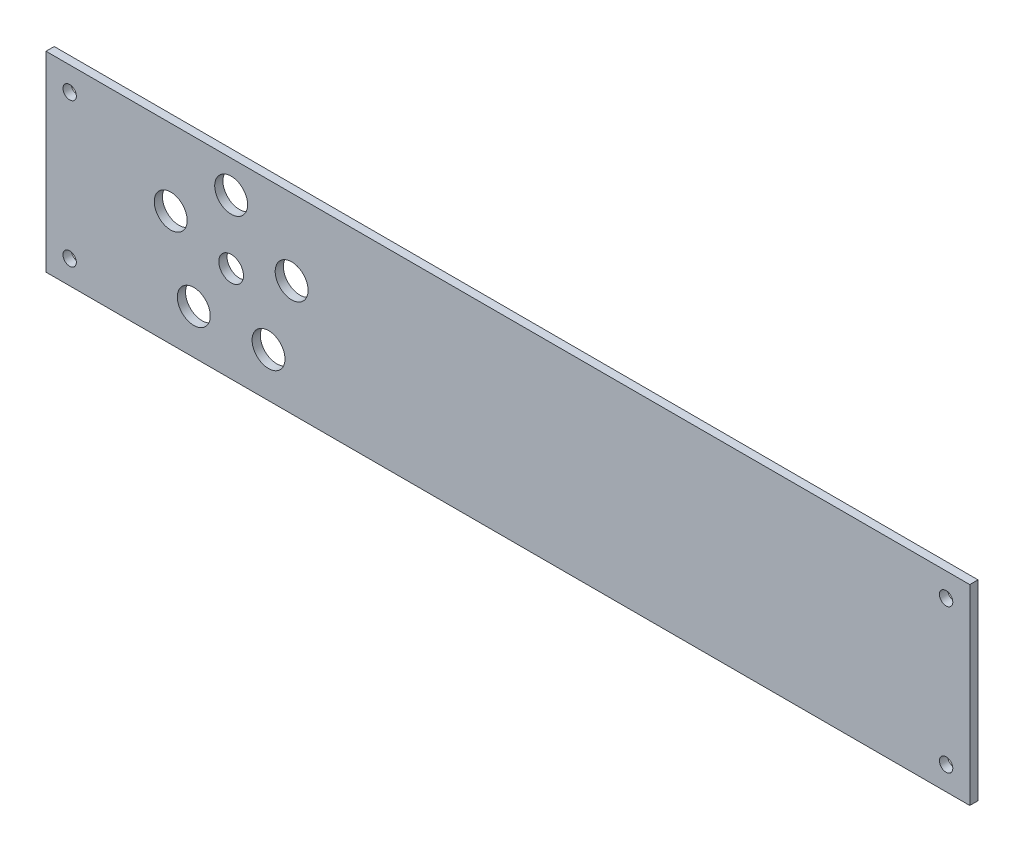
ISO-10303-21;
HEADER;
FILE_DESCRIPTION(('STEP AP214'),'2;1');
FILE_NAME('part.step','',(''),(''),'','','');
FILE_SCHEMA(('AUTOMOTIVE_DESIGN { 1 0 10303 214 1 1 1 1 }'));
ENDSEC;
DATA;
#1=APPLICATION_CONTEXT('core data for automotive mechanical design processes');
#2=APPLICATION_PROTOCOL_DEFINITION('international standard','automotive_design',2000,#1);
#3=PRODUCT_CONTEXT('',#1,'mechanical');
#4=PRODUCT('Part','Part','',(#3));
#5=PRODUCT_RELATED_PRODUCT_CATEGORY('part','',(#4));
#6=PRODUCT_DEFINITION_FORMATION('','',#4);
#7=PRODUCT_DEFINITION_CONTEXT('part definition',#1,'design');
#8=PRODUCT_DEFINITION('design','',#6,#7);
#9=PRODUCT_DEFINITION_SHAPE('','',#8);
#10=(LENGTH_UNIT() NAMED_UNIT(*) SI_UNIT(.MILLI.,.METRE.));
#11=(NAMED_UNIT(*) PLANE_ANGLE_UNIT() SI_UNIT($,.RADIAN.));
#12=(NAMED_UNIT(*) SI_UNIT($,.STERADIAN.) SOLID_ANGLE_UNIT());
#13=UNCERTAINTY_MEASURE_WITH_UNIT(LENGTH_MEASURE(1.E-05),#10,'distance_accuracy_value','');
#14=(GEOMETRIC_REPRESENTATION_CONTEXT(3) GLOBAL_UNCERTAINTY_ASSIGNED_CONTEXT((#13)) GLOBAL_UNIT_ASSIGNED_CONTEXT((#10,
#11,#12)) REPRESENTATION_CONTEXT('',''));
#15=CARTESIAN_POINT('',(0.,0.,0.));
#16=DIRECTION('',(0.,0.,1.));
#17=DIRECTION('',(1.,0.,0.));
#18=AXIS2_PLACEMENT_3D('',#15,#16,#17);
#19=CARTESIAN_POINT('',(0.,0.,4.));
#20=DIRECTION('',(0.,0.,1.));
#21=DIRECTION('',(1.,0.,0.));
#22=AXIS2_PLACEMENT_3D('',#19,#20,#21);
#23=PLANE('',#22);
#24=CARTESIAN_POINT('',(-377.163563200134,21.4999999999999,4.));
#25=DIRECTION('',(0.,0.,1.));
#26=DIRECTION('',(1.,0.,0.));
#27=AXIS2_PLACEMENT_3D('',#24,#25,#26);
#28=CIRCLE('',#27,7.99999999999998);
#29=CARTESIAN_POINT('',(-369.163563200134,21.4999999999999,4.));
#30=VERTEX_POINT('',#29);
#31=EDGE_CURVE('E223',#30,#30,#28,.T.);
#32=ORIENTED_EDGE('',*,*,#31,.F.);
#33=EDGE_LOOP('',(#32));
#34=FACE_BOUND('',#33,.T.);
#35=CARTESIAN_POINT('',(-329.610737385376,56.0491502812527,4.));
#36=DIRECTION('',(0.,0.,1.));
#37=DIRECTION('',(1.,0.,0.));
#38=AXIS2_PLACEMENT_3D('',#35,#36,#37);
#39=CIRCLE('',#38,7.99999999999998);
#40=CARTESIAN_POINT('',(-321.610737385376,56.0491502812527,4.));
#41=VERTEX_POINT('',#40);
#42=EDGE_CURVE('E168',#41,#41,#39,.T.);
#43=ORIENTED_EDGE('',*,*,#42,.F.);
#44=EDGE_LOOP('',(#43));
#45=FACE_BOUND('',#44,.T.);
#46=CARTESIAN_POINT('',(-11.5,11.5000000000001,4.));
#47=DIRECTION('',(0.,0.,1.));
#48=DIRECTION('',(1.,0.,0.));
#49=AXIS2_PLACEMENT_3D('',#46,#47,#48);
#50=CIRCLE('',#49,3.25);
#51=CARTESIAN_POINT('',(-8.24999999999996,11.5000000000001,4.));
#52=VERTEX_POINT('',#51);
#53=EDGE_CURVE('E169',#52,#52,#50,.T.);
#54=ORIENTED_EDGE('',*,*,#53,.F.);
#55=EDGE_LOOP('',(#54));
#56=FACE_BOUND('',#55,.T.);
#57=CARTESIAN_POINT('',(-359.,77.4016994374947,4.));
#58=DIRECTION('',(0.,0.,1.));
#59=DIRECTION('',(1.,0.,0.));
#60=AXIS2_PLACEMENT_3D('',#57,#58,#59);
#61=CIRCLE('',#60,7.99999999999999);
#62=CARTESIAN_POINT('',(-351.,77.4016994374947,4.));
#63=VERTEX_POINT('',#62);
#64=EDGE_CURVE('E186',#63,#63,#61,.T.);
#65=ORIENTED_EDGE('',*,*,#64,.F.);
#66=EDGE_LOOP('',(#65));
#67=FACE_BOUND('',#66,.T.);
#68=CARTESIAN_POINT('',(-437.5,81.4999999999999,4.));
#69=DIRECTION('',(0.,0.,1.));
#70=DIRECTION('',(1.,0.,0.));
#71=AXIS2_PLACEMENT_3D('',#68,#69,#70);
#72=CIRCLE('',#71,3.24999999999995);
#73=CARTESIAN_POINT('',(-434.25,81.4999999999999,4.));
#74=VERTEX_POINT('',#73);
#75=EDGE_CURVE('E120',#74,#74,#72,.T.);
#76=ORIENTED_EDGE('',*,*,#75,.F.);
#77=EDGE_LOOP('',(#76));
#78=FACE_BOUND('',#77,.T.);
#79=DIRECTION('',(0.,1.,0.));
#80=VECTOR('',#79,1.);
#81=CARTESIAN_POINT('',(0.,0.,4.));
#82=LINE('',#81,#80);
#83=CARTESIAN_POINT('',(0.,0.,4.));
#84=VERTEX_POINT('',#83);
#85=CARTESIAN_POINT('',(0.,92.9999999999999,4.));
#86=VERTEX_POINT('',#85);
#87=EDGE_CURVE('E100',#84,#86,#82,.T.);
#88=ORIENTED_EDGE('',*,*,#87,.T.);
#89=DIRECTION('',(-1.,0.,0.));
#90=VECTOR('',#89,1.);
#91=CARTESIAN_POINT('',(0.,92.9999999999999,4.));
#92=LINE('',#91,#90);
#93=CARTESIAN_POINT('',(-449.,92.9999999999999,4.));
#94=VERTEX_POINT('',#93);
#95=EDGE_CURVE('E95',#86,#94,#92,.T.);
#96=ORIENTED_EDGE('',*,*,#95,.T.);
#97=DIRECTION('',(0.,-1.,0.));
#98=VECTOR('',#97,1.);
#99=CARTESIAN_POINT('',(-449.,0.,4.));
#100=LINE('',#99,#98);
#101=CARTESIAN_POINT('',(-449.,0.,4.));
#102=VERTEX_POINT('',#101);
#103=EDGE_CURVE('E98',#94,#102,#100,.T.);
#104=ORIENTED_EDGE('',*,*,#103,.T.);
#105=DIRECTION('',(1.,0.,0.));
#106=VECTOR('',#105,1.);
#107=CARTESIAN_POINT('',(0.,0.,4.));
#108=LINE('',#107,#106);
#109=EDGE_CURVE('E63',#102,#84,#108,.T.);
#110=ORIENTED_EDGE('',*,*,#109,.T.);
#111=EDGE_LOOP('',(#88,#96,#104,#110));
#112=FACE_BOUND('',#111,.T.);
#113=CARTESIAN_POINT('',(-388.389262614624,56.0491502812526,4.));
#114=DIRECTION('',(0.,0.,1.));
#115=DIRECTION('',(1.,0.,0.));
#116=AXIS2_PLACEMENT_3D('',#113,#114,#115);
#117=CIRCLE('',#116,7.99999999999998);
#118=CARTESIAN_POINT('',(-380.389262614624,56.0491502812526,4.));
#119=VERTEX_POINT('',#118);
#120=EDGE_CURVE('E142',#119,#119,#117,.T.);
#121=ORIENTED_EDGE('',*,*,#120,.F.);
#122=EDGE_LOOP('',(#121));
#123=FACE_BOUND('',#122,.T.);
#124=CARTESIAN_POINT('',(-11.5,81.4999999999998,4.));
#125=DIRECTION('',(0.,0.,1.));
#126=DIRECTION('',(-1.,0.,0.));
#127=AXIS2_PLACEMENT_3D('',#124,#125,#126);
#128=CIRCLE('',#127,3.25);
#129=CARTESIAN_POINT('',(-14.75,81.4999999999998,4.));
#130=VERTEX_POINT('',#129);
#131=EDGE_CURVE('E187',#130,#130,#128,.T.);
#132=ORIENTED_EDGE('',*,*,#131,.F.);
#133=EDGE_LOOP('',(#132));
#134=FACE_BOUND('',#133,.T.);
#135=CARTESIAN_POINT('',(-437.5,11.4999999999999,4.));
#136=DIRECTION('',(0.,0.,1.));
#137=DIRECTION('',(-1.,0.,0.));
#138=AXIS2_PLACEMENT_3D('',#135,#136,#137);
#139=CIRCLE('',#138,3.24999999999995);
#140=CARTESIAN_POINT('',(-440.75,11.4999999999999,4.));
#141=VERTEX_POINT('',#140);
#142=EDGE_CURVE('E155',#141,#141,#139,.T.);
#143=ORIENTED_EDGE('',*,*,#142,.F.);
#144=EDGE_LOOP('',(#143));
#145=FACE_BOUND('',#144,.T.);
#146=CARTESIAN_POINT('',(-340.836436799866,21.5,4.));
#147=DIRECTION('',(0.,0.,1.));
#148=DIRECTION('',(1.,0.,0.));
#149=AXIS2_PLACEMENT_3D('',#146,#147,#148);
#150=CIRCLE('',#149,8.00000000000003);
#151=CARTESIAN_POINT('',(-332.836436799866,21.5,4.));
#152=VERTEX_POINT('',#151);
#153=EDGE_CURVE('E211',#152,#152,#150,.T.);
#154=ORIENTED_EDGE('',*,*,#153,.F.);
#155=EDGE_LOOP('',(#154));
#156=FACE_BOUND('',#155,.T.);
#157=CARTESIAN_POINT('',(-359.,46.4999999999999,4.));
#158=DIRECTION('',(0.,0.,1.));
#159=DIRECTION('',(1.,0.,0.));
#160=AXIS2_PLACEMENT_3D('',#157,#158,#159);
#161=CIRCLE('',#160,5.99999999999999);
#162=CARTESIAN_POINT('',(-353.,46.4999999999999,4.));
#163=VERTEX_POINT('',#162);
#164=EDGE_CURVE('E214',#163,#163,#161,.T.);
#165=ORIENTED_EDGE('',*,*,#164,.F.);
#166=EDGE_LOOP('',(#165));
#167=FACE_BOUND('',#166,.T.);
#168=ADVANCED_FACE('F45',(#34,#45,#56,#67,#78,#112,#123,#134,#145,#156,#167),#23,.T.);
#169=CARTESIAN_POINT('',(0.,0.,0.));
#170=DIRECTION('',(0.,0.,1.));
#171=DIRECTION('',(1.,0.,0.));
#172=AXIS2_PLACEMENT_3D('',#169,#170,#171);
#173=PLANE('',#172);
#174=DIRECTION('',(0.,1.,0.));
#175=VECTOR('',#174,1.);
#176=CARTESIAN_POINT('',(0.,0.,0.));
#177=LINE('',#176,#175);
#178=CARTESIAN_POINT('',(0.,0.,0.));
#179=VERTEX_POINT('',#178);
#180=CARTESIAN_POINT('',(0.,92.9999999999999,0.));
#181=VERTEX_POINT('',#180);
#182=EDGE_CURVE('E116',#179,#181,#177,.T.);
#183=ORIENTED_EDGE('',*,*,#182,.F.);
#184=DIRECTION('',(1.,0.,0.));
#185=VECTOR('',#184,1.);
#186=CARTESIAN_POINT('',(0.,0.,0.));
#187=LINE('',#186,#185);
#188=CARTESIAN_POINT('',(-449.,0.,0.));
#189=VERTEX_POINT('',#188);
#190=EDGE_CURVE('E88',#189,#179,#187,.T.);
#191=ORIENTED_EDGE('',*,*,#190,.F.);
#192=DIRECTION('',(0.,-1.,0.));
#193=VECTOR('',#192,1.);
#194=CARTESIAN_POINT('',(-449.,0.,0.));
#195=LINE('',#194,#193);
#196=CARTESIAN_POINT('',(-449.,92.9999999999999,0.));
#197=VERTEX_POINT('',#196);
#198=EDGE_CURVE('E82',#197,#189,#195,.T.);
#199=ORIENTED_EDGE('',*,*,#198,.F.);
#200=DIRECTION('',(-1.,0.,0.));
#201=VECTOR('',#200,1.);
#202=CARTESIAN_POINT('',(0.,92.9999999999999,0.));
#203=LINE('',#202,#201);
#204=EDGE_CURVE('E105',#181,#197,#203,.T.);
#205=ORIENTED_EDGE('',*,*,#204,.F.);
#206=EDGE_LOOP('',(#183,#191,#199,#205));
#207=FACE_BOUND('',#206,.T.);
#208=CARTESIAN_POINT('',(-437.5,81.4999999999999,0.));
#209=DIRECTION('',(0.,0.,1.));
#210=DIRECTION('',(1.,0.,0.));
#211=AXIS2_PLACEMENT_3D('',#208,#209,#210);
#212=CIRCLE('',#211,3.24999999999995);
#213=CARTESIAN_POINT('',(-434.25,81.4999999999999,0.));
#214=VERTEX_POINT('',#213);
#215=EDGE_CURVE('E138',#214,#214,#212,.T.);
#216=ORIENTED_EDGE('',*,*,#215,.T.);
#217=EDGE_LOOP('',(#216));
#218=FACE_BOUND('',#217,.T.);
#219=CARTESIAN_POINT('',(-388.389262614624,56.0491502812526,0.));
#220=DIRECTION('',(0.,0.,1.));
#221=DIRECTION('',(1.,0.,0.));
#222=AXIS2_PLACEMENT_3D('',#219,#220,#221);
#223=CIRCLE('',#222,7.99999999999998);
#224=CARTESIAN_POINT('',(-380.389262614624,56.0491502812526,0.));
#225=VERTEX_POINT('',#224);
#226=EDGE_CURVE('E147',#225,#225,#223,.T.);
#227=ORIENTED_EDGE('',*,*,#226,.T.);
#228=EDGE_LOOP('',(#227));
#229=FACE_BOUND('',#228,.T.);
#230=CARTESIAN_POINT('',(-359.,77.4016994374947,0.));
#231=DIRECTION('',(0.,0.,1.));
#232=DIRECTION('',(1.,0.,0.));
#233=AXIS2_PLACEMENT_3D('',#230,#231,#232);
#234=CIRCLE('',#233,7.99999999999999);
#235=CARTESIAN_POINT('',(-351.,77.4016994374947,0.));
#236=VERTEX_POINT('',#235);
#237=EDGE_CURVE('E183',#236,#236,#234,.T.);
#238=ORIENTED_EDGE('',*,*,#237,.T.);
#239=EDGE_LOOP('',(#238));
#240=FACE_BOUND('',#239,.T.);
#241=CARTESIAN_POINT('',(-11.5,81.4999999999998,0.));
#242=DIRECTION('',(0.,0.,1.));
#243=DIRECTION('',(-1.,0.,0.));
#244=AXIS2_PLACEMENT_3D('',#241,#242,#243);
#245=CIRCLE('',#244,3.25);
#246=CARTESIAN_POINT('',(-14.75,81.4999999999998,0.));
#247=VERTEX_POINT('',#246);
#248=EDGE_CURVE('E174',#247,#247,#245,.T.);
#249=ORIENTED_EDGE('',*,*,#248,.T.);
#250=EDGE_LOOP('',(#249));
#251=FACE_BOUND('',#250,.T.);
#252=CARTESIAN_POINT('',(-11.5,11.5000000000001,0.));
#253=DIRECTION('',(0.,0.,1.));
#254=DIRECTION('',(1.,0.,0.));
#255=AXIS2_PLACEMENT_3D('',#252,#253,#254);
#256=CIRCLE('',#255,3.25);
#257=CARTESIAN_POINT('',(-8.24999999999996,11.5000000000001,0.));
#258=VERTEX_POINT('',#257);
#259=EDGE_CURVE('E161',#258,#258,#256,.T.);
#260=ORIENTED_EDGE('',*,*,#259,.T.);
#261=EDGE_LOOP('',(#260));
#262=FACE_BOUND('',#261,.T.);
#263=CARTESIAN_POINT('',(-437.5,11.4999999999999,0.));
#264=DIRECTION('',(0.,0.,1.));
#265=DIRECTION('',(-1.,0.,0.));
#266=AXIS2_PLACEMENT_3D('',#263,#264,#265);
#267=CIRCLE('',#266,3.24999999999995);
#268=CARTESIAN_POINT('',(-440.75,11.4999999999999,0.));
#269=VERTEX_POINT('',#268);
#270=EDGE_CURVE('E162',#269,#269,#267,.T.);
#271=ORIENTED_EDGE('',*,*,#270,.T.);
#272=EDGE_LOOP('',(#271));
#273=FACE_BOUND('',#272,.T.);
#274=CARTESIAN_POINT('',(-329.610737385376,56.0491502812527,0.));
#275=DIRECTION('',(0.,0.,1.));
#276=DIRECTION('',(1.,0.,0.));
#277=AXIS2_PLACEMENT_3D('',#274,#275,#276);
#278=CIRCLE('',#277,7.99999999999998);
#279=CARTESIAN_POINT('',(-321.610737385376,56.0491502812527,0.));
#280=VERTEX_POINT('',#279);
#281=EDGE_CURVE('E163',#280,#280,#278,.T.);
#282=ORIENTED_EDGE('',*,*,#281,.T.);
#283=EDGE_LOOP('',(#282));
#284=FACE_BOUND('',#283,.T.);
#285=CARTESIAN_POINT('',(-340.836436799866,21.5,0.));
#286=DIRECTION('',(0.,0.,1.));
#287=DIRECTION('',(1.,0.,0.));
#288=AXIS2_PLACEMENT_3D('',#285,#286,#287);
#289=CIRCLE('',#288,8.00000000000003);
#290=CARTESIAN_POINT('',(-332.836436799866,21.5,0.));
#291=VERTEX_POINT('',#290);
#292=EDGE_CURVE('E234',#291,#291,#289,.T.);
#293=ORIENTED_EDGE('',*,*,#292,.T.);
#294=EDGE_LOOP('',(#293));
#295=FACE_BOUND('',#294,.T.);
#296=CARTESIAN_POINT('',(-377.163563200134,21.4999999999999,0.));
#297=DIRECTION('',(0.,0.,1.));
#298=DIRECTION('',(1.,0.,0.));
#299=AXIS2_PLACEMENT_3D('',#296,#297,#298);
#300=CIRCLE('',#299,7.99999999999998);
#301=CARTESIAN_POINT('',(-369.163563200134,21.4999999999999,0.));
#302=VERTEX_POINT('',#301);
#303=EDGE_CURVE('E217',#302,#302,#300,.T.);
#304=ORIENTED_EDGE('',*,*,#303,.T.);
#305=EDGE_LOOP('',(#304));
#306=FACE_BOUND('',#305,.T.);
#307=CARTESIAN_POINT('',(-359.,46.4999999999999,0.));
#308=DIRECTION('',(0.,0.,1.));
#309=DIRECTION('',(1.,0.,0.));
#310=AXIS2_PLACEMENT_3D('',#307,#308,#309);
#311=CIRCLE('',#310,5.99999999999999);
#312=CARTESIAN_POINT('',(-353.,46.4999999999999,0.));
#313=VERTEX_POINT('',#312);
#314=EDGE_CURVE('E218',#313,#313,#311,.T.);
#315=ORIENTED_EDGE('',*,*,#314,.T.);
#316=EDGE_LOOP('',(#315));
#317=FACE_BOUND('',#316,.T.);
#318=ADVANCED_FACE('F133',(#207,#218,#229,#240,#251,#262,#273,#284,#295,#306,#317),#173,.F.);
#319=CARTESIAN_POINT('',(0.,0.,4.));
#320=DIRECTION('',(-1.,0.,0.));
#321=DIRECTION('',(0.,0.,1.));
#322=AXIS2_PLACEMENT_3D('',#319,#320,#321);
#323=PLANE('',#322);
#324=ORIENTED_EDGE('',*,*,#182,.T.);
#325=DIRECTION('',(0.,0.,-1.));
#326=VECTOR('',#325,1.);
#327=CARTESIAN_POINT('',(0.,92.9999999999999,4.));
#328=LINE('',#327,#326);
#329=EDGE_CURVE('E12',#86,#181,#328,.T.);
#330=ORIENTED_EDGE('',*,*,#329,.F.);
#331=ORIENTED_EDGE('',*,*,#87,.F.);
#332=DIRECTION('',(0.,0.,-1.));
#333=VECTOR('',#332,1.);
#334=CARTESIAN_POINT('',(0.,0.,4.));
#335=LINE('',#334,#333);
#336=EDGE_CURVE('E112',#84,#179,#335,.T.);
#337=ORIENTED_EDGE('',*,*,#336,.T.);
#338=EDGE_LOOP('',(#324,#330,#331,#337));
#339=FACE_BOUND('',#338,.T.);
#340=ADVANCED_FACE('F47',(#339),#323,.F.);
#341=CARTESIAN_POINT('',(0.,92.9999999999999,4.));
#342=DIRECTION('',(0.,-1.,0.));
#343=DIRECTION('',(1.,0.,0.));
#344=AXIS2_PLACEMENT_3D('',#341,#342,#343);
#345=PLANE('',#344);
#346=ORIENTED_EDGE('',*,*,#204,.T.);
#347=DIRECTION('',(0.,0.,-1.));
#348=VECTOR('',#347,1.);
#349=CARTESIAN_POINT('',(-449.,92.9999999999999,4.));
#350=LINE('',#349,#348);
#351=EDGE_CURVE('E55',#94,#197,#350,.T.);
#352=ORIENTED_EDGE('',*,*,#351,.F.);
#353=ORIENTED_EDGE('',*,*,#95,.F.);
#354=ORIENTED_EDGE('',*,*,#329,.T.);
#355=EDGE_LOOP('',(#346,#352,#353,#354));
#356=FACE_BOUND('',#355,.T.);
#357=ADVANCED_FACE('F104',(#356),#345,.F.);
#358=CARTESIAN_POINT('',(-449.,0.,4.));
#359=DIRECTION('',(1.,0.,0.));
#360=DIRECTION('',(0.,1.,0.));
#361=AXIS2_PLACEMENT_3D('',#358,#359,#360);
#362=PLANE('',#361);
#363=ORIENTED_EDGE('',*,*,#198,.T.);
#364=DIRECTION('',(0.,0.,-1.));
#365=VECTOR('',#364,1.);
#366=CARTESIAN_POINT('',(-449.,0.,4.));
#367=LINE('',#366,#365);
#368=EDGE_CURVE('E107',#102,#189,#367,.T.);
#369=ORIENTED_EDGE('',*,*,#368,.F.);
#370=ORIENTED_EDGE('',*,*,#103,.F.);
#371=ORIENTED_EDGE('',*,*,#351,.T.);
#372=EDGE_LOOP('',(#363,#369,#370,#371));
#373=FACE_BOUND('',#372,.T.);
#374=ADVANCED_FACE('F108',(#373),#362,.F.);
#375=CARTESIAN_POINT('',(0.,0.,4.));
#376=DIRECTION('',(0.,1.,0.));
#377=DIRECTION('',(-1.,0.,0.));
#378=AXIS2_PLACEMENT_3D('',#375,#376,#377);
#379=PLANE('',#378);
#380=ORIENTED_EDGE('',*,*,#190,.T.);
#381=ORIENTED_EDGE('',*,*,#336,.F.);
#382=ORIENTED_EDGE('',*,*,#109,.F.);
#383=ORIENTED_EDGE('',*,*,#368,.T.);
#384=EDGE_LOOP('',(#380,#381,#382,#383));
#385=FACE_BOUND('',#384,.T.);
#386=ADVANCED_FACE('F130',(#385),#379,.F.);
#387=CARTESIAN_POINT('',(-437.5,81.4999999999999,4.));
#388=DIRECTION('',(0.,0.,-1.));
#389=DIRECTION('',(-1.,0.,0.));
#390=AXIS2_PLACEMENT_3D('',#387,#388,#389);
#391=CYLINDRICAL_SURFACE('',#390,3.24999999999995);
#392=ORIENTED_EDGE('',*,*,#75,.T.);
#393=EDGE_LOOP('',(#392));
#394=FACE_BOUND('',#393,.T.);
#395=ORIENTED_EDGE('',*,*,#215,.F.);
#396=EDGE_LOOP('',(#395));
#397=FACE_BOUND('',#396,.T.);
#398=ADVANCED_FACE('F255',(#394,#397),#391,.F.);
#399=CARTESIAN_POINT('',(-388.389262614624,56.0491502812526,4.));
#400=DIRECTION('',(0.,0.,-1.));
#401=DIRECTION('',(-1.,0.,0.));
#402=AXIS2_PLACEMENT_3D('',#399,#400,#401);
#403=CYLINDRICAL_SURFACE('',#402,7.99999999999998);
#404=ORIENTED_EDGE('',*,*,#120,.T.);
#405=EDGE_LOOP('',(#404));
#406=FACE_BOUND('',#405,.T.);
#407=ORIENTED_EDGE('',*,*,#226,.F.);
#408=EDGE_LOOP('',(#407));
#409=FACE_BOUND('',#408,.T.);
#410=ADVANCED_FACE('F258',(#406,#409),#403,.F.);
#411=CARTESIAN_POINT('',(-359.,77.4016994374947,4.));
#412=DIRECTION('',(0.,0.,-1.));
#413=DIRECTION('',(-1.,0.,0.));
#414=AXIS2_PLACEMENT_3D('',#411,#412,#413);
#415=CYLINDRICAL_SURFACE('',#414,7.99999999999999);
#416=ORIENTED_EDGE('',*,*,#64,.T.);
#417=EDGE_LOOP('',(#416));
#418=FACE_BOUND('',#417,.T.);
#419=ORIENTED_EDGE('',*,*,#237,.F.);
#420=EDGE_LOOP('',(#419));
#421=FACE_BOUND('',#420,.T.);
#422=ADVANCED_FACE('F311',(#418,#421),#415,.F.);
#423=CARTESIAN_POINT('',(-11.5,81.4999999999998,4.));
#424=DIRECTION('',(0.,0.,-1.));
#425=DIRECTION('',(-1.,0.,0.));
#426=AXIS2_PLACEMENT_3D('',#423,#424,#425);
#427=CYLINDRICAL_SURFACE('',#426,3.25);
#428=ORIENTED_EDGE('',*,*,#131,.T.);
#429=EDGE_LOOP('',(#428));
#430=FACE_BOUND('',#429,.T.);
#431=ORIENTED_EDGE('',*,*,#248,.F.);
#432=EDGE_LOOP('',(#431));
#433=FACE_BOUND('',#432,.T.);
#434=ADVANCED_FACE('F199',(#430,#433),#427,.F.);
#435=CARTESIAN_POINT('',(-11.5,11.5000000000001,4.));
#436=DIRECTION('',(0.,0.,-1.));
#437=DIRECTION('',(-1.,0.,0.));
#438=AXIS2_PLACEMENT_3D('',#435,#436,#437);
#439=CYLINDRICAL_SURFACE('',#438,3.25);
#440=ORIENTED_EDGE('',*,*,#53,.T.);
#441=EDGE_LOOP('',(#440));
#442=FACE_BOUND('',#441,.T.);
#443=ORIENTED_EDGE('',*,*,#259,.F.);
#444=EDGE_LOOP('',(#443));
#445=FACE_BOUND('',#444,.T.);
#446=ADVANCED_FACE('F304',(#442,#445),#439,.F.);
#447=CARTESIAN_POINT('',(-437.5,11.4999999999999,4.));
#448=DIRECTION('',(0.,0.,-1.));
#449=DIRECTION('',(-1.,0.,0.));
#450=AXIS2_PLACEMENT_3D('',#447,#448,#449);
#451=CYLINDRICAL_SURFACE('',#450,3.24999999999995);
#452=ORIENTED_EDGE('',*,*,#142,.T.);
#453=EDGE_LOOP('',(#452));
#454=FACE_BOUND('',#453,.T.);
#455=ORIENTED_EDGE('',*,*,#270,.F.);
#456=EDGE_LOOP('',(#455));
#457=FACE_BOUND('',#456,.T.);
#458=ADVANCED_FACE('F300',(#454,#457),#451,.F.);
#459=CARTESIAN_POINT('',(-329.610737385376,56.0491502812527,4.));
#460=DIRECTION('',(0.,0.,-1.));
#461=DIRECTION('',(-1.,0.,0.));
#462=AXIS2_PLACEMENT_3D('',#459,#460,#461);
#463=CYLINDRICAL_SURFACE('',#462,7.99999999999998);
#464=ORIENTED_EDGE('',*,*,#42,.T.);
#465=EDGE_LOOP('',(#464));
#466=FACE_BOUND('',#465,.T.);
#467=ORIENTED_EDGE('',*,*,#281,.F.);
#468=EDGE_LOOP('',(#467));
#469=FACE_BOUND('',#468,.T.);
#470=ADVANCED_FACE('F296',(#466,#469),#463,.F.);
#471=CARTESIAN_POINT('',(-340.836436799866,21.5,4.));
#472=DIRECTION('',(0.,0.,-1.));
#473=DIRECTION('',(-1.,0.,0.));
#474=AXIS2_PLACEMENT_3D('',#471,#472,#473);
#475=CYLINDRICAL_SURFACE('',#474,8.00000000000003);
#476=ORIENTED_EDGE('',*,*,#153,.T.);
#477=EDGE_LOOP('',(#476));
#478=FACE_BOUND('',#477,.T.);
#479=ORIENTED_EDGE('',*,*,#292,.F.);
#480=EDGE_LOOP('',(#479));
#481=FACE_BOUND('',#480,.T.);
#482=ADVANCED_FACE('F291',(#478,#481),#475,.F.);
#483=CARTESIAN_POINT('',(-377.163563200134,21.4999999999999,4.));
#484=DIRECTION('',(0.,0.,-1.));
#485=DIRECTION('',(-1.,0.,0.));
#486=AXIS2_PLACEMENT_3D('',#483,#484,#485);
#487=CYLINDRICAL_SURFACE('',#486,7.99999999999998);
#488=ORIENTED_EDGE('',*,*,#31,.T.);
#489=EDGE_LOOP('',(#488));
#490=FACE_BOUND('',#489,.T.);
#491=ORIENTED_EDGE('',*,*,#303,.F.);
#492=EDGE_LOOP('',(#491));
#493=FACE_BOUND('',#492,.T.);
#494=ADVANCED_FACE('F244',(#490,#493),#487,.F.);
#495=CARTESIAN_POINT('',(-359.,46.4999999999999,4.));
#496=DIRECTION('',(0.,0.,-1.));
#497=DIRECTION('',(-1.,0.,0.));
#498=AXIS2_PLACEMENT_3D('',#495,#496,#497);
#499=CYLINDRICAL_SURFACE('',#498,5.99999999999999);
#500=ORIENTED_EDGE('',*,*,#164,.T.);
#501=EDGE_LOOP('',(#500));
#502=FACE_BOUND('',#501,.T.);
#503=ORIENTED_EDGE('',*,*,#314,.F.);
#504=EDGE_LOOP('',(#503));
#505=FACE_BOUND('',#504,.T.);
#506=ADVANCED_FACE('F285',(#502,#505),#499,.F.);
#507=CLOSED_SHELL('',(#168,#318,#340,#357,#374,#386,#398,#410,#422,#434,#446,#458,#470,#482,
#494,#506));
#508=MANIFOLD_SOLID_BREP('B2',#507);
#509=ADVANCED_BREP_SHAPE_REPRESENTATION('',(#18,#508),#14);
#510=SHAPE_DEFINITION_REPRESENTATION(#9,#509);
ENDSEC;
END-ISO-10303-21;
